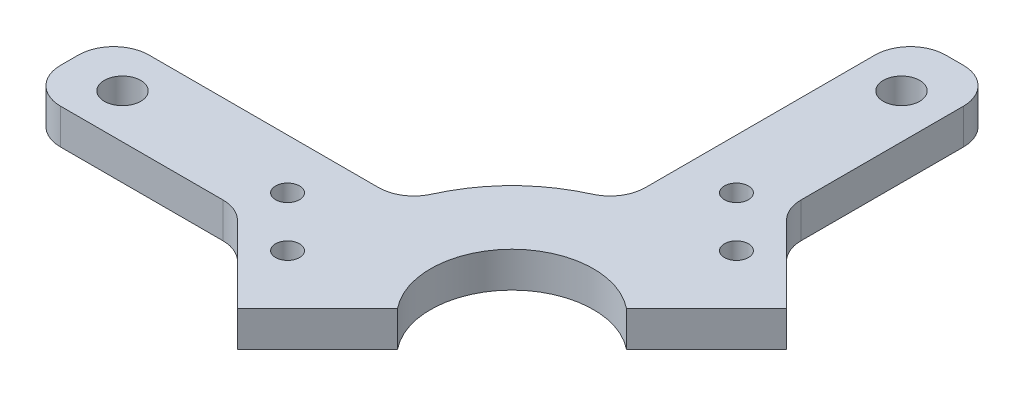
ISO-10303-21;
HEADER;
FILE_DESCRIPTION(('STEP AP214'),'2;1');
FILE_NAME('part.step','',(''),(''),'','','');
FILE_SCHEMA(('AUTOMOTIVE_DESIGN { 1 0 10303 214 1 1 1 1 }'));
ENDSEC;
DATA;
#1=APPLICATION_CONTEXT('core data for automotive mechanical design processes');
#2=APPLICATION_PROTOCOL_DEFINITION('international standard','automotive_design',2000,#1);
#3=PRODUCT_CONTEXT('',#1,'mechanical');
#4=PRODUCT('Part','Part','',(#3));
#5=PRODUCT_RELATED_PRODUCT_CATEGORY('part','',(#4));
#6=PRODUCT_DEFINITION_FORMATION('','',#4);
#7=PRODUCT_DEFINITION_CONTEXT('part definition',#1,'design');
#8=PRODUCT_DEFINITION('design','',#6,#7);
#9=PRODUCT_DEFINITION_SHAPE('','',#8);
#10=(LENGTH_UNIT() NAMED_UNIT(*) SI_UNIT(.MILLI.,.METRE.));
#11=(NAMED_UNIT(*) PLANE_ANGLE_UNIT() SI_UNIT($,.RADIAN.));
#12=(NAMED_UNIT(*) SI_UNIT($,.STERADIAN.) SOLID_ANGLE_UNIT());
#13=UNCERTAINTY_MEASURE_WITH_UNIT(LENGTH_MEASURE(1.E-05),#10,'distance_accuracy_value','');
#14=(GEOMETRIC_REPRESENTATION_CONTEXT(3) GLOBAL_UNCERTAINTY_ASSIGNED_CONTEXT((#13)) GLOBAL_UNIT_ASSIGNED_CONTEXT((#10,
#11,#12)) REPRESENTATION_CONTEXT('',''));
#15=CARTESIAN_POINT('',(0.,0.,0.));
#16=DIRECTION('',(0.,0.,1.));
#17=DIRECTION('',(1.,0.,0.));
#18=AXIS2_PLACEMENT_3D('',#15,#16,#17);
#19=CARTESIAN_POINT('',(7.93750000000073,0.,-73.0249999999999));
#20=DIRECTION('',(1.,0.,0.));
#21=DIRECTION('',(0.,0.,-1.));
#22=AXIS2_PLACEMENT_3D('',#19,#20,#21);
#23=PLANE('',#22);
#24=DIRECTION('',(0.,0.,-1.));
#25=VECTOR('',#24,1.);
#26=CARTESIAN_POINT('',(7.93750000000073,6.35,-73.0249999999999));
#27=LINE('',#26,#25);
#28=CARTESIAN_POINT('',(7.93750000000044,6.35,-43.9246129988201));
#29=VERTEX_POINT('',#28);
#30=CARTESIAN_POINT('',(7.93750000000073,6.35,-73.0249999999999));
#31=VERTEX_POINT('',#30);
#32=EDGE_CURVE('E234',#29,#31,#27,.T.);
#33=ORIENTED_EDGE('',*,*,#32,.F.);
#34=DIRECTION('',(0.,-1.,0.));
#35=VECTOR('',#34,1.);
#36=CARTESIAN_POINT('',(7.93750000000044,0.,-43.9246129988201));
#37=LINE('',#36,#35);
#38=CARTESIAN_POINT('',(7.93750000000044,0.,-43.9246129988201));
#39=VERTEX_POINT('',#38);
#40=EDGE_CURVE('E401',#29,#39,#37,.T.);
#41=ORIENTED_EDGE('',*,*,#40,.T.);
#42=DIRECTION('',(0.,0.,-1.));
#43=VECTOR('',#42,1.);
#44=CARTESIAN_POINT('',(7.93750000000073,0.,-73.0249999999999));
#45=LINE('',#44,#43);
#46=CARTESIAN_POINT('',(7.93750000000073,0.,-73.0249999999999));
#47=VERTEX_POINT('',#46);
#48=EDGE_CURVE('E302',#39,#47,#45,.T.);
#49=ORIENTED_EDGE('',*,*,#48,.T.);
#50=DIRECTION('',(0.,1.,0.));
#51=VECTOR('',#50,1.);
#52=CARTESIAN_POINT('',(7.93750000000073,0.,-73.0249999999999));
#53=LINE('',#52,#51);
#54=EDGE_CURVE('E297',#47,#31,#53,.T.);
#55=ORIENTED_EDGE('',*,*,#54,.T.);
#56=EDGE_LOOP('',(#33,#41,#49,#55));
#57=FACE_BOUND('',#56,.T.);
#58=ADVANCED_FACE('F38',(#57),#23,.T.);
#59=CARTESIAN_POINT('',(0.,6.35,0.));
#60=DIRECTION('',(0.,1.,0.));
#61=DIRECTION('',(0.,0.,1.));
#62=AXIS2_PLACEMENT_3D('',#59,#60,#61);
#63=PLANE('',#62);
#64=CARTESIAN_POINT('',(10.0230122421383,6.35,-30.2285885145439));
#65=DIRECTION('',(0.,1.,0.));
#66=DIRECTION('',(0.,0.,1.));
#67=AXIS2_PLACEMENT_3D('',#64,#65,#66);
#68=CIRCLE('',#67,2.15265);
#69=CARTESIAN_POINT('',(10.0230122421383,6.35,-28.0759385145439));
#70=VERTEX_POINT('',#69);
#71=EDGE_CURVE('E507',#70,#70,#68,.T.);
#72=ORIENTED_EDGE('',*,*,#71,.F.);
#73=EDGE_LOOP('',(#72));
#74=FACE_BOUND('',#73,.T.);
#75=CARTESIAN_POINT('',(1.04275612106917,6.35,-39.208844635613));
#76=DIRECTION('',(0.,1.,0.));
#77=DIRECTION('',(0.,0.,1.));
#78=AXIS2_PLACEMENT_3D('',#75,#76,#77);
#79=CIRCLE('',#78,2.15265);
#80=CARTESIAN_POINT('',(1.04275612106917,6.35,-37.056194635613));
#81=VERTEX_POINT('',#80);
#82=EDGE_CURVE('E495',#81,#81,#79,.T.);
#83=ORIENTED_EDGE('',*,*,#82,.F.);
#84=EDGE_LOOP('',(#83));
#85=FACE_BOUND('',#84,.T.);
#86=DIRECTION('',(0.,0.,1.));
#87=VECTOR('',#86,1.);
#88=CARTESIAN_POINT('',(-7.93749999999926,6.35,-73.0250000000001));
#89=LINE('',#88,#87);
#90=CARTESIAN_POINT('',(-7.93749999999926,6.35,-73.0250000000001));
#91=VERTEX_POINT('',#90);
#92=CARTESIAN_POINT('',(-7.93749999999969,6.35,-31.8688400910671));
#93=VERTEX_POINT('',#92);
#94=EDGE_CURVE('E315',#91,#93,#89,.T.);
#95=ORIENTED_EDGE('',*,*,#94,.T.);
#96=CARTESIAN_POINT('',(-14.2874999999997,6.35,-31.8688400910672));
#97=DIRECTION('',(0.,1.,0.));
#98=DIRECTION('',(0.,0.,1.));
#99=AXIS2_PLACEMENT_3D('',#96,#97,#98);
#100=CIRCLE('',#99,6.35);
#101=CARTESIAN_POINT('',(-11.6897727272725,6.35,-26.0745055290549));
#102=VERTEX_POINT('',#101);
#103=EDGE_CURVE('E392',#93,#102,#100,.F.);
#104=ORIENTED_EDGE('',*,*,#103,.T.);
#105=CARTESIAN_POINT('',(0.,6.35,0.));
#106=DIRECTION('',(0.,1.,0.));
#107=DIRECTION('',(0.,0.,1.));
#108=AXIS2_PLACEMENT_3D('',#105,#106,#107);
#109=CIRCLE('',#108,28.575);
#110=CARTESIAN_POINT('',(-26.0745055290548,6.35,-11.6897727272727));
#111=VERTEX_POINT('',#110);
#112=EDGE_CURVE('E281',#102,#111,#109,.T.);
#113=ORIENTED_EDGE('',*,*,#112,.T.);
#114=CARTESIAN_POINT('',(-31.868840091067,6.35,-14.2875));
#115=DIRECTION('',(0.,1.,0.));
#116=DIRECTION('',(0.,0.,1.));
#117=AXIS2_PLACEMENT_3D('',#114,#115,#116);
#118=CIRCLE('',#117,6.35);
#119=CARTESIAN_POINT('',(-31.868840091067,6.35,-7.93749999999998));
#120=VERTEX_POINT('',#119);
#121=EDGE_CURVE('E395',#111,#120,#118,.F.);
#122=ORIENTED_EDGE('',*,*,#121,.T.);
#123=DIRECTION('',(-1.,0.,0.));
#124=VECTOR('',#123,1.);
#125=CARTESIAN_POINT('',(-73.025,6.35,-7.93749999999997));
#126=LINE('',#125,#124);
#127=CARTESIAN_POINT('',(-73.025,6.35,-7.93749999999997));
#128=VERTEX_POINT('',#127);
#129=EDGE_CURVE('E278',#120,#128,#126,.T.);
#130=ORIENTED_EDGE('',*,*,#129,.T.);
#131=CARTESIAN_POINT('',(-73.025,6.35,-1.58749999999997));
#132=DIRECTION('',(0.,1.,0.));
#133=DIRECTION('',(0.,0.,1.));
#134=AXIS2_PLACEMENT_3D('',#131,#132,#133);
#135=CIRCLE('',#134,6.35);
#136=CARTESIAN_POINT('',(-79.375,6.35,-1.58749999999997));
#137=VERTEX_POINT('',#136);
#138=EDGE_CURVE('E274',#128,#137,#135,.T.);
#139=ORIENTED_EDGE('',*,*,#138,.T.);
#140=DIRECTION('',(0.,0.,1.));
#141=VECTOR('',#140,1.);
#142=CARTESIAN_POINT('',(-79.375,6.35,-1.58749999999997));
#143=LINE('',#142,#141);
#144=CARTESIAN_POINT('',(-79.375,6.35,1.58750000000003));
#145=VERTEX_POINT('',#144);
#146=EDGE_CURVE('E270',#137,#145,#143,.T.);
#147=ORIENTED_EDGE('',*,*,#146,.T.);
#148=CARTESIAN_POINT('',(-73.025,6.35,1.58750000000003));
#149=DIRECTION('',(0.,1.,0.));
#150=DIRECTION('',(0.,0.,-1.));
#151=AXIS2_PLACEMENT_3D('',#148,#149,#150);
#152=CIRCLE('',#151,6.35);
#153=CARTESIAN_POINT('',(-73.025,6.35,7.93750000000003));
#154=VERTEX_POINT('',#153);
#155=EDGE_CURVE('E266',#145,#154,#152,.T.);
#156=ORIENTED_EDGE('',*,*,#155,.T.);
#157=DIRECTION('',(1.,0.,0.));
#158=VECTOR('',#157,1.);
#159=CARTESIAN_POINT('',(-73.025,6.35,7.93750000000003));
#160=LINE('',#159,#158);
#161=CARTESIAN_POINT('',(-43.9246129988205,6.35,7.93750000000003));
#162=VERTEX_POINT('',#161);
#163=EDGE_CURVE('E262',#154,#162,#160,.T.);
#164=ORIENTED_EDGE('',*,*,#163,.T.);
#165=CARTESIAN_POINT('',(-43.9246129988205,6.35,14.2875));
#166=DIRECTION('',(0.,1.,0.));
#167=DIRECTION('',(0.,0.,1.));
#168=AXIS2_PLACEMENT_3D('',#165,#166,#167);
#169=CIRCLE('',#168,6.35);
#170=CARTESIAN_POINT('',(-39.4344849382859,6.35,9.79737193946545));
#171=VERTEX_POINT('',#170);
#172=EDGE_CURVE('E11',#162,#171,#169,.F.);
#173=ORIENTED_EDGE('',*,*,#172,.T.);
#174=DIRECTION('',(0.707106781186548,0.,0.707106781186547));
#175=VECTOR('',#174,1.);
#176=CARTESIAN_POINT('',(-25.7384604540093,6.35,23.4933964237421));
#177=LINE('',#176,#175);
#178=CARTESIAN_POINT('',(-25.7384604540093,6.35,23.4933964237421));
#179=VERTEX_POINT('',#178);
#180=EDGE_CURVE('E224',#171,#179,#177,.T.);
#181=ORIENTED_EDGE('',*,*,#180,.T.);
#182=DIRECTION('',(-0.707106781186546,0.,0.707106781186549));
#183=VECTOR('',#182,1.);
#184=CARTESIAN_POINT('',(-38.2941829917116,6.35,36.0491189614445));
#185=LINE('',#184,#183);
#186=CARTESIAN_POINT('',(-11.3886381111663,6.35,9.14357408089908));
#187=VERTEX_POINT('',#186);
#188=EDGE_CURVE('E242',#187,#179,#185,.T.);
#189=ORIENTED_EDGE('',*,*,#188,.F.);
#190=CARTESIAN_POINT('',(0.,6.35,0.));
#191=DIRECTION('',(0.,1.,0.));
#192=DIRECTION('',(0.,0.,1.));
#193=AXIS2_PLACEMENT_3D('',#190,#191,#192);
#194=CIRCLE('',#193,14.605);
#195=CARTESIAN_POINT('',(9.14357408089904,6.35,-11.3886381111664));
#196=VERTEX_POINT('',#195);
#197=EDGE_CURVE('E362',#196,#187,#194,.T.);
#198=ORIENTED_EDGE('',*,*,#197,.F.);
#199=CARTESIAN_POINT('',(23.4933964237421,6.35,-25.7384604540093));
#200=VERTEX_POINT('',#199);
#201=EDGE_CURVE('E238',#200,#196,#185,.T.);
#202=ORIENTED_EDGE('',*,*,#201,.F.);
#203=DIRECTION('',(0.707106781186547,0.,0.707106781186547));
#204=VECTOR('',#203,1.);
#205=CARTESIAN_POINT('',(23.4933964237421,6.35,-25.7384604540093));
#206=LINE('',#205,#204);
#207=CARTESIAN_POINT('',(9.79737193946587,6.35,-39.4344849382855));
#208=VERTEX_POINT('',#207);
#209=EDGE_CURVE('E188',#208,#200,#206,.T.);
#210=ORIENTED_EDGE('',*,*,#209,.F.);
#211=CARTESIAN_POINT('',(14.2875000000004,6.35,-43.9246129988201));
#212=DIRECTION('',(0.,1.,0.));
#213=DIRECTION('',(0.,0.,1.));
#214=AXIS2_PLACEMENT_3D('',#211,#212,#213);
#215=CIRCLE('',#214,6.35);
#216=EDGE_CURVE('E416',#208,#29,#215,.F.);
#217=ORIENTED_EDGE('',*,*,#216,.T.);
#218=ORIENTED_EDGE('',*,*,#32,.T.);
#219=CARTESIAN_POINT('',(1.58750000000073,6.35,-73.025));
#220=DIRECTION('',(0.,1.,0.));
#221=DIRECTION('',(-1.,0.,0.));
#222=AXIS2_PLACEMENT_3D('',#219,#220,#221);
#223=CIRCLE('',#222,6.35);
#224=CARTESIAN_POINT('',(1.5875000000008,6.35,-79.375));
#225=VERTEX_POINT('',#224);
#226=EDGE_CURVE('E326',#31,#225,#223,.T.);
#227=ORIENTED_EDGE('',*,*,#226,.T.);
#228=DIRECTION('',(-1.,0.,0.));
#229=VECTOR('',#228,1.);
#230=CARTESIAN_POINT('',(1.5875000000008,6.35,-79.375));
#231=LINE('',#230,#229);
#232=CARTESIAN_POINT('',(-1.5874999999992,6.35,-79.375));
#233=VERTEX_POINT('',#232);
#234=EDGE_CURVE('E322',#225,#233,#231,.T.);
#235=ORIENTED_EDGE('',*,*,#234,.T.);
#236=CARTESIAN_POINT('',(-1.58749999999927,6.35,-73.025));
#237=DIRECTION('',(0.,1.,0.));
#238=DIRECTION('',(1.,0.,0.));
#239=AXIS2_PLACEMENT_3D('',#236,#237,#238);
#240=CIRCLE('',#239,6.35);
#241=EDGE_CURVE('E318',#233,#91,#240,.T.);
#242=ORIENTED_EDGE('',*,*,#241,.T.);
#243=EDGE_LOOP('',(#95,#104,#113,#122,#130,#139,#147,#156,#164,#173,#181,#189,#198,#202,#210,
#217,#218,#227,#235,#242));
#244=FACE_BOUND('',#243,.T.);
#245=CARTESIAN_POINT('',(7.31639914554578E-13,6.35,-69.85));
#246=DIRECTION('',(0.,1.,0.));
#247=DIRECTION('',(0.,0.,1.));
#248=AXIS2_PLACEMENT_3D('',#245,#246,#247);
#249=CIRCLE('',#248,3.2639);
#250=CARTESIAN_POINT('',(7.31639914554578E-13,6.35,-66.5861));
#251=VERTEX_POINT('',#250);
#252=EDGE_CURVE('E243',#251,#251,#249,.T.);
#253=ORIENTED_EDGE('',*,*,#252,.F.);
#254=EDGE_LOOP('',(#253));
#255=FACE_BOUND('',#254,.T.);
#256=CARTESIAN_POINT('',(-30.2285885145439,6.35,10.0230122421383));
#257=DIRECTION('',(0.,1.,0.));
#258=DIRECTION('',(0.,0.,1.));
#259=AXIS2_PLACEMENT_3D('',#256,#257,#258);
#260=CIRCLE('',#259,2.15265);
#261=CARTESIAN_POINT('',(-30.2285885145439,6.35,12.1756622421383));
#262=VERTEX_POINT('',#261);
#263=EDGE_CURVE('E205',#262,#262,#260,.T.);
#264=ORIENTED_EDGE('',*,*,#263,.F.);
#265=EDGE_LOOP('',(#264));
#266=FACE_BOUND('',#265,.T.);
#267=CARTESIAN_POINT('',(-39.208844635613,6.35,1.04275612106918));
#268=DIRECTION('',(0.,1.,0.));
#269=DIRECTION('',(0.,0.,1.));
#270=AXIS2_PLACEMENT_3D('',#267,#268,#269);
#271=CIRCLE('',#270,2.15265);
#272=CARTESIAN_POINT('',(-39.208844635613,6.35,3.19540612106918));
#273=VERTEX_POINT('',#272);
#274=EDGE_CURVE('E216',#273,#273,#271,.T.);
#275=ORIENTED_EDGE('',*,*,#274,.F.);
#276=EDGE_LOOP('',(#275));
#277=FACE_BOUND('',#276,.T.);
#278=CARTESIAN_POINT('',(-69.85,6.35,0.));
#279=DIRECTION('',(0.,1.,0.));
#280=DIRECTION('',(0.,0.,1.));
#281=AXIS2_PLACEMENT_3D('',#278,#279,#280);
#282=CIRCLE('',#281,3.2639);
#283=CARTESIAN_POINT('',(-69.85,6.35,3.2639));
#284=VERTEX_POINT('',#283);
#285=EDGE_CURVE('E306',#284,#284,#282,.T.);
#286=ORIENTED_EDGE('',*,*,#285,.F.);
#287=EDGE_LOOP('',(#286));
#288=FACE_BOUND('',#287,.T.);
#289=ADVANCED_FACE('F426',(#74,#85,#244,#255,#266,#277,#288),#63,.T.);
#290=CARTESIAN_POINT('',(0.,0.,0.));
#291=DIRECTION('',(0.,1.,0.));
#292=DIRECTION('',(0.,0.,1.));
#293=AXIS2_PLACEMENT_3D('',#290,#291,#292);
#294=PLANE('',#293);
#295=CARTESIAN_POINT('',(10.0230122421383,0.,-30.2285885145439));
#296=DIRECTION('',(0.,1.,0.));
#297=DIRECTION('',(0.,0.,1.));
#298=AXIS2_PLACEMENT_3D('',#295,#296,#297);
#299=CIRCLE('',#298,2.15265);
#300=CARTESIAN_POINT('',(10.0230122421383,0.,-28.0759385145439));
#301=VERTEX_POINT('',#300);
#302=EDGE_CURVE('E501',#301,#301,#299,.T.);
#303=ORIENTED_EDGE('',*,*,#302,.T.);
#304=EDGE_LOOP('',(#303));
#305=FACE_BOUND('',#304,.T.);
#306=CARTESIAN_POINT('',(1.04275612106917,0.,-39.208844635613));
#307=DIRECTION('',(0.,1.,0.));
#308=DIRECTION('',(0.,0.,1.));
#309=AXIS2_PLACEMENT_3D('',#306,#307,#308);
#310=CIRCLE('',#309,2.15265);
#311=CARTESIAN_POINT('',(1.04275612106917,0.,-37.056194635613));
#312=VERTEX_POINT('',#311);
#313=EDGE_CURVE('E492',#312,#312,#310,.T.);
#314=ORIENTED_EDGE('',*,*,#313,.T.);
#315=EDGE_LOOP('',(#314));
#316=FACE_BOUND('',#315,.T.);
#317=DIRECTION('',(-0.707106781186546,0.,0.707106781186549));
#318=VECTOR('',#317,1.);
#319=CARTESIAN_POINT('',(-38.2941829917116,0.,36.0491189614445));
#320=LINE('',#319,#318);
#321=CARTESIAN_POINT('',(23.4933964237421,0.,-25.7384604540093));
#322=VERTEX_POINT('',#321);
#323=CARTESIAN_POINT('',(9.14357408089904,0.,-11.3886381111664));
#324=VERTEX_POINT('',#323);
#325=EDGE_CURVE('E179',#322,#324,#320,.T.);
#326=ORIENTED_EDGE('',*,*,#325,.T.);
#327=CARTESIAN_POINT('',(0.,0.,0.));
#328=DIRECTION('',(0.,1.,0.));
#329=DIRECTION('',(0.,0.,1.));
#330=AXIS2_PLACEMENT_3D('',#327,#328,#329);
#331=CIRCLE('',#330,14.605);
#332=CARTESIAN_POINT('',(-11.3886381111663,0.,9.14357408089908));
#333=VERTEX_POINT('',#332);
#334=EDGE_CURVE('E197',#324,#333,#331,.T.);
#335=ORIENTED_EDGE('',*,*,#334,.T.);
#336=CARTESIAN_POINT('',(-25.7384604540093,0.,23.4933964237421));
#337=VERTEX_POINT('',#336);
#338=EDGE_CURVE('E200',#333,#337,#320,.T.);
#339=ORIENTED_EDGE('',*,*,#338,.T.);
#340=DIRECTION('',(0.707106781186548,0.,0.707106781186547));
#341=VECTOR('',#340,1.);
#342=CARTESIAN_POINT('',(-25.7384604540093,0.,23.4933964237421));
#343=LINE('',#342,#341);
#344=CARTESIAN_POINT('',(-39.4344849382859,0.,9.79737193946545));
#345=VERTEX_POINT('',#344);
#346=EDGE_CURVE('E225',#345,#337,#343,.T.);
#347=ORIENTED_EDGE('',*,*,#346,.F.);
#348=CARTESIAN_POINT('',(-43.9246129988205,0.,14.2875));
#349=DIRECTION('',(0.,1.,0.));
#350=DIRECTION('',(0.,0.,1.));
#351=AXIS2_PLACEMENT_3D('',#348,#349,#350);
#352=CIRCLE('',#351,6.35);
#353=CARTESIAN_POINT('',(-43.9246129988205,0.,7.93750000000003));
#354=VERTEX_POINT('',#353);
#355=EDGE_CURVE('E47',#345,#354,#352,.T.);
#356=ORIENTED_EDGE('',*,*,#355,.T.);
#357=DIRECTION('',(1.,0.,0.));
#358=VECTOR('',#357,1.);
#359=CARTESIAN_POINT('',(-73.025,0.,7.93750000000003));
#360=LINE('',#359,#358);
#361=CARTESIAN_POINT('',(-73.025,0.,7.93750000000003));
#362=VERTEX_POINT('',#361);
#363=EDGE_CURVE('E282',#362,#354,#360,.T.);
#364=ORIENTED_EDGE('',*,*,#363,.F.);
#365=CARTESIAN_POINT('',(-73.025,0.,1.58750000000003));
#366=DIRECTION('',(0.,1.,0.));
#367=DIRECTION('',(0.,0.,-1.));
#368=AXIS2_PLACEMENT_3D('',#365,#366,#367);
#369=CIRCLE('',#368,6.35);
#370=CARTESIAN_POINT('',(-79.375,0.,1.58750000000003));
#371=VERTEX_POINT('',#370);
#372=EDGE_CURVE('E248',#371,#362,#369,.T.);
#373=ORIENTED_EDGE('',*,*,#372,.F.);
#374=DIRECTION('',(0.,0.,1.));
#375=VECTOR('',#374,1.);
#376=CARTESIAN_POINT('',(-79.375,0.,-1.58749999999997));
#377=LINE('',#376,#375);
#378=CARTESIAN_POINT('',(-79.375,0.,-1.58749999999997));
#379=VERTEX_POINT('',#378);
#380=EDGE_CURVE('E258',#379,#371,#377,.T.);
#381=ORIENTED_EDGE('',*,*,#380,.F.);
#382=CARTESIAN_POINT('',(-73.025,0.,-1.58749999999997));
#383=DIRECTION('',(0.,1.,0.));
#384=DIRECTION('',(0.,0.,1.));
#385=AXIS2_PLACEMENT_3D('',#382,#383,#384);
#386=CIRCLE('',#385,6.35);
#387=CARTESIAN_POINT('',(-73.025,0.,-7.93749999999997));
#388=VERTEX_POINT('',#387);
#389=EDGE_CURVE('E254',#388,#379,#386,.T.);
#390=ORIENTED_EDGE('',*,*,#389,.F.);
#391=DIRECTION('',(-1.,0.,0.));
#392=VECTOR('',#391,1.);
#393=CARTESIAN_POINT('',(-73.025,0.,-7.93749999999997));
#394=LINE('',#393,#392);
#395=CARTESIAN_POINT('',(-31.868840091067,0.,-7.93749999999998));
#396=VERTEX_POINT('',#395);
#397=EDGE_CURVE('E249',#396,#388,#394,.T.);
#398=ORIENTED_EDGE('',*,*,#397,.F.);
#399=CARTESIAN_POINT('',(-31.868840091067,0.,-14.2875));
#400=DIRECTION('',(0.,1.,0.));
#401=DIRECTION('',(0.,0.,1.));
#402=AXIS2_PLACEMENT_3D('',#399,#400,#401);
#403=CIRCLE('',#402,6.35);
#404=CARTESIAN_POINT('',(-26.0745055290548,0.,-11.6897727272727));
#405=VERTEX_POINT('',#404);
#406=EDGE_CURVE('E398',#396,#405,#403,.T.);
#407=ORIENTED_EDGE('',*,*,#406,.T.);
#408=CARTESIAN_POINT('',(0.,0.,0.));
#409=DIRECTION('',(0.,1.,0.));
#410=DIRECTION('',(0.,0.,1.));
#411=AXIS2_PLACEMENT_3D('',#408,#409,#410);
#412=CIRCLE('',#411,28.575);
#413=CARTESIAN_POINT('',(-11.6897727272725,0.,-26.0745055290549));
#414=VERTEX_POINT('',#413);
#415=EDGE_CURVE('E285',#414,#405,#412,.T.);
#416=ORIENTED_EDGE('',*,*,#415,.F.);
#417=CARTESIAN_POINT('',(-14.2874999999997,0.,-31.8688400910672));
#418=DIRECTION('',(0.,1.,0.));
#419=DIRECTION('',(0.,0.,1.));
#420=AXIS2_PLACEMENT_3D('',#417,#418,#419);
#421=CIRCLE('',#420,6.35);
#422=CARTESIAN_POINT('',(-7.93749999999969,0.,-31.8688400910671));
#423=VERTEX_POINT('',#422);
#424=EDGE_CURVE('E388',#414,#423,#421,.T.);
#425=ORIENTED_EDGE('',*,*,#424,.T.);
#426=DIRECTION('',(0.,0.,1.));
#427=VECTOR('',#426,1.);
#428=CARTESIAN_POINT('',(-7.93749999999926,0.,-73.0250000000001));
#429=LINE('',#428,#427);
#430=CARTESIAN_POINT('',(-7.93749999999926,0.,-73.0250000000001));
#431=VERTEX_POINT('',#430);
#432=EDGE_CURVE('E253',#431,#423,#429,.T.);
#433=ORIENTED_EDGE('',*,*,#432,.F.);
#434=CARTESIAN_POINT('',(-1.58749999999927,0.,-73.025));
#435=DIRECTION('',(0.,1.,0.));
#436=DIRECTION('',(1.,0.,0.));
#437=AXIS2_PLACEMENT_3D('',#434,#435,#436);
#438=CIRCLE('',#437,6.35);
#439=CARTESIAN_POINT('',(-1.5874999999992,0.,-79.375));
#440=VERTEX_POINT('',#439);
#441=EDGE_CURVE('E301',#440,#431,#438,.T.);
#442=ORIENTED_EDGE('',*,*,#441,.F.);
#443=DIRECTION('',(-1.,0.,0.));
#444=VECTOR('',#443,1.);
#445=CARTESIAN_POINT('',(1.5875000000008,0.,-79.375));
#446=LINE('',#445,#444);
#447=CARTESIAN_POINT('',(1.5875000000008,0.,-79.375));
#448=VERTEX_POINT('',#447);
#449=EDGE_CURVE('E311',#448,#440,#446,.T.);
#450=ORIENTED_EDGE('',*,*,#449,.F.);
#451=CARTESIAN_POINT('',(1.58750000000073,0.,-73.025));
#452=DIRECTION('',(0.,1.,0.));
#453=DIRECTION('',(-1.,0.,0.));
#454=AXIS2_PLACEMENT_3D('',#451,#452,#453);
#455=CIRCLE('',#454,6.35);
#456=EDGE_CURVE('E307',#47,#448,#455,.T.);
#457=ORIENTED_EDGE('',*,*,#456,.F.);
#458=ORIENTED_EDGE('',*,*,#48,.F.);
#459=CARTESIAN_POINT('',(14.2875000000004,0.,-43.9246129988201));
#460=DIRECTION('',(0.,1.,0.));
#461=DIRECTION('',(0.,0.,1.));
#462=AXIS2_PLACEMENT_3D('',#459,#460,#461);
#463=CIRCLE('',#462,6.35);
#464=CARTESIAN_POINT('',(9.79737193946587,0.,-39.4344849382855));
#465=VERTEX_POINT('',#464);
#466=EDGE_CURVE('E182',#39,#465,#463,.T.);
#467=ORIENTED_EDGE('',*,*,#466,.T.);
#468=DIRECTION('',(0.707106781186547,0.,0.707106781186547));
#469=VECTOR('',#468,1.);
#470=CARTESIAN_POINT('',(23.4933964237421,0.,-25.7384604540093));
#471=LINE('',#470,#469);
#472=EDGE_CURVE('E174',#465,#322,#471,.T.);
#473=ORIENTED_EDGE('',*,*,#472,.T.);
#474=EDGE_LOOP('',(#326,#335,#339,#347,#356,#364,#373,#381,#390,#398,#407,#416,#425,#433,#442,
#450,#457,#458,#467,#473));
#475=FACE_BOUND('',#474,.T.);
#476=CARTESIAN_POINT('',(7.31639914554578E-13,0.,-69.85));
#477=DIRECTION('',(0.,1.,0.));
#478=DIRECTION('',(0.,0.,1.));
#479=AXIS2_PLACEMENT_3D('',#476,#477,#478);
#480=CIRCLE('',#479,3.2639);
#481=CARTESIAN_POINT('',(7.31639914554578E-13,0.,-66.5861));
#482=VERTEX_POINT('',#481);
#483=EDGE_CURVE('E198',#482,#482,#480,.T.);
#484=ORIENTED_EDGE('',*,*,#483,.T.);
#485=EDGE_LOOP('',(#484));
#486=FACE_BOUND('',#485,.T.);
#487=CARTESIAN_POINT('',(-69.85,0.,0.));
#488=DIRECTION('',(0.,1.,0.));
#489=DIRECTION('',(0.,0.,1.));
#490=AXIS2_PLACEMENT_3D('',#487,#488,#489);
#491=CIRCLE('',#490,3.2639);
#492=CARTESIAN_POINT('',(-69.85,0.,3.2639));
#493=VERTEX_POINT('',#492);
#494=EDGE_CURVE('E265',#493,#493,#491,.T.);
#495=ORIENTED_EDGE('',*,*,#494,.T.);
#496=EDGE_LOOP('',(#495));
#497=FACE_BOUND('',#496,.T.);
#498=CARTESIAN_POINT('',(-39.208844635613,0.,1.04275612106918));
#499=DIRECTION('',(0.,1.,0.));
#500=DIRECTION('',(0.,0.,1.));
#501=AXIS2_PLACEMENT_3D('',#498,#499,#500);
#502=CIRCLE('',#501,2.15265);
#503=CARTESIAN_POINT('',(-39.208844635613,0.,3.19540612106918));
#504=VERTEX_POINT('',#503);
#505=EDGE_CURVE('E220',#504,#504,#502,.T.);
#506=ORIENTED_EDGE('',*,*,#505,.T.);
#507=EDGE_LOOP('',(#506));
#508=FACE_BOUND('',#507,.T.);
#509=CARTESIAN_POINT('',(-30.2285885145439,0.,10.0230122421383));
#510=DIRECTION('',(0.,1.,0.));
#511=DIRECTION('',(0.,0.,1.));
#512=AXIS2_PLACEMENT_3D('',#509,#510,#511);
#513=CIRCLE('',#512,2.15265);
#514=CARTESIAN_POINT('',(-30.2285885145439,0.,12.1756622421383));
#515=VERTEX_POINT('',#514);
#516=EDGE_CURVE('E209',#515,#515,#513,.T.);
#517=ORIENTED_EDGE('',*,*,#516,.T.);
#518=EDGE_LOOP('',(#517));
#519=FACE_BOUND('',#518,.T.);
#520=ADVANCED_FACE('F176',(#305,#316,#475,#486,#497,#508,#519),#294,.F.);
#521=CARTESIAN_POINT('',(0.,6.35,0.));
#522=DIRECTION('',(0.,-1.,0.));
#523=DIRECTION('',(0.,0.,-1.));
#524=AXIS2_PLACEMENT_3D('',#521,#522,#523);
#525=CYLINDRICAL_SURFACE('',#524,14.605);
#526=DIRECTION('',(0.,-1.,0.));
#527=VECTOR('',#526,1.);
#528=CARTESIAN_POINT('',(9.14357408089904,6.35,-11.3886381111664));
#529=LINE('',#528,#527);
#530=EDGE_CURVE('E194',#196,#324,#529,.T.);
#531=ORIENTED_EDGE('',*,*,#530,.F.);
#532=ORIENTED_EDGE('',*,*,#197,.T.);
#533=DIRECTION('',(0.,-1.,0.));
#534=VECTOR('',#533,1.);
#535=CARTESIAN_POINT('',(-11.3886381111663,6.35,9.14357408089908));
#536=LINE('',#535,#534);
#537=EDGE_CURVE('E239',#333,#187,#536,.F.);
#538=ORIENTED_EDGE('',*,*,#537,.F.);
#539=ORIENTED_EDGE('',*,*,#334,.F.);
#540=EDGE_LOOP('',(#531,#532,#538,#539));
#541=FACE_BOUND('',#540,.T.);
#542=ADVANCED_FACE('F423',(#541),#525,.F.);
#543=CARTESIAN_POINT('',(0.,6.35,0.));
#544=DIRECTION('',(0.,-1.,0.));
#545=DIRECTION('',(0.,0.,-1.));
#546=AXIS2_PLACEMENT_3D('',#543,#544,#545);
#547=CYLINDRICAL_SURFACE('',#546,28.575);
#548=ORIENTED_EDGE('',*,*,#112,.F.);
#549=DIRECTION('',(0.,-1.,0.));
#550=VECTOR('',#549,1.);
#551=CARTESIAN_POINT('',(-11.6897727272725,6.35,-26.0745055290549));
#552=LINE('',#551,#550);
#553=EDGE_CURVE('E377',#102,#414,#552,.T.);
#554=ORIENTED_EDGE('',*,*,#553,.T.);
#555=ORIENTED_EDGE('',*,*,#415,.T.);
#556=DIRECTION('',(0.,-1.,0.));
#557=VECTOR('',#556,1.);
#558=CARTESIAN_POINT('',(-26.0745055290548,6.35,-11.6897727272727));
#559=LINE('',#558,#557);
#560=EDGE_CURVE('E237',#405,#111,#559,.F.);
#561=ORIENTED_EDGE('',*,*,#560,.T.);
#562=EDGE_LOOP('',(#548,#554,#555,#561));
#563=FACE_BOUND('',#562,.T.);
#564=ADVANCED_FACE('F461',(#563),#547,.T.);
#565=CARTESIAN_POINT('',(-73.025,0.,7.93750000000003));
#566=DIRECTION('',(0.,0.,1.));
#567=DIRECTION('',(1.,0.,0.));
#568=AXIS2_PLACEMENT_3D('',#565,#566,#567);
#569=PLANE('',#568);
#570=ORIENTED_EDGE('',*,*,#363,.T.);
#571=DIRECTION('',(0.,-1.,0.));
#572=VECTOR('',#571,1.);
#573=CARTESIAN_POINT('',(-43.9246129988205,6.35,7.93750000000002));
#574=LINE('',#573,#572);
#575=EDGE_CURVE('E60',#354,#162,#574,.F.);
#576=ORIENTED_EDGE('',*,*,#575,.T.);
#577=ORIENTED_EDGE('',*,*,#163,.F.);
#578=DIRECTION('',(0.,1.,0.));
#579=VECTOR('',#578,1.);
#580=CARTESIAN_POINT('',(-73.025,0.,7.93750000000003));
#581=LINE('',#580,#579);
#582=EDGE_CURVE('E259',#362,#154,#581,.T.);
#583=ORIENTED_EDGE('',*,*,#582,.F.);
#584=EDGE_LOOP('',(#570,#576,#577,#583));
#585=FACE_BOUND('',#584,.T.);
#586=ADVANCED_FACE('F438',(#585),#569,.T.);
#587=CARTESIAN_POINT('',(-73.025,0.,-7.93749999999997));
#588=DIRECTION('',(0.,0.,-1.));
#589=DIRECTION('',(-1.,0.,0.));
#590=AXIS2_PLACEMENT_3D('',#587,#588,#589);
#591=PLANE('',#590);
#592=DIRECTION('',(0.,1.,0.));
#593=VECTOR('',#592,1.);
#594=CARTESIAN_POINT('',(-73.025,0.,-7.93749999999997));
#595=LINE('',#594,#593);
#596=EDGE_CURVE('E244',#388,#128,#595,.T.);
#597=ORIENTED_EDGE('',*,*,#596,.T.);
#598=ORIENTED_EDGE('',*,*,#129,.F.);
#599=DIRECTION('',(0.,-1.,0.));
#600=VECTOR('',#599,1.);
#601=CARTESIAN_POINT('',(-31.868840091067,0.,-7.93749999999998));
#602=LINE('',#601,#600);
#603=EDGE_CURVE('E385',#120,#396,#602,.T.);
#604=ORIENTED_EDGE('',*,*,#603,.T.);
#605=ORIENTED_EDGE('',*,*,#397,.T.);
#606=EDGE_LOOP('',(#597,#598,#604,#605));
#607=FACE_BOUND('',#606,.T.);
#608=ADVANCED_FACE('F608',(#607),#591,.T.);
#609=CARTESIAN_POINT('',(-73.025,0.,1.58750000000003));
#610=DIRECTION('',(0.,1.,0.));
#611=DIRECTION('',(0.,0.,1.));
#612=AXIS2_PLACEMENT_3D('',#609,#610,#611);
#613=CYLINDRICAL_SURFACE('',#612,6.35);
#614=ORIENTED_EDGE('',*,*,#155,.F.);
#615=DIRECTION('',(0.,1.,0.));
#616=VECTOR('',#615,1.);
#617=CARTESIAN_POINT('',(-79.375,0.,1.58750000000003));
#618=LINE('',#617,#616);
#619=EDGE_CURVE('E255',#371,#145,#618,.T.);
#620=ORIENTED_EDGE('',*,*,#619,.F.);
#621=ORIENTED_EDGE('',*,*,#372,.T.);
#622=ORIENTED_EDGE('',*,*,#582,.T.);
#623=EDGE_LOOP('',(#614,#620,#621,#622));
#624=FACE_BOUND('',#623,.T.);
#625=ADVANCED_FACE('F441',(#624),#613,.T.);
#626=CARTESIAN_POINT('',(-79.375,0.,-1.58749999999997));
#627=DIRECTION('',(-1.,0.,0.));
#628=DIRECTION('',(0.,0.,1.));
#629=AXIS2_PLACEMENT_3D('',#626,#627,#628);
#630=PLANE('',#629);
#631=ORIENTED_EDGE('',*,*,#146,.F.);
#632=DIRECTION('',(0.,1.,0.));
#633=VECTOR('',#632,1.);
#634=CARTESIAN_POINT('',(-79.375,0.,-1.58749999999997));
#635=LINE('',#634,#633);
#636=EDGE_CURVE('E250',#379,#137,#635,.T.);
#637=ORIENTED_EDGE('',*,*,#636,.F.);
#638=ORIENTED_EDGE('',*,*,#380,.T.);
#639=ORIENTED_EDGE('',*,*,#619,.T.);
#640=EDGE_LOOP('',(#631,#637,#638,#639));
#641=FACE_BOUND('',#640,.T.);
#642=ADVANCED_FACE('F446',(#641),#630,.T.);
#643=CARTESIAN_POINT('',(-73.025,0.,-1.58749999999997));
#644=DIRECTION('',(0.,1.,0.));
#645=DIRECTION('',(0.,0.,1.));
#646=AXIS2_PLACEMENT_3D('',#643,#644,#645);
#647=CYLINDRICAL_SURFACE('',#646,6.35);
#648=ORIENTED_EDGE('',*,*,#138,.F.);
#649=ORIENTED_EDGE('',*,*,#596,.F.);
#650=ORIENTED_EDGE('',*,*,#389,.T.);
#651=ORIENTED_EDGE('',*,*,#636,.T.);
#652=EDGE_LOOP('',(#648,#649,#650,#651));
#653=FACE_BOUND('',#652,.T.);
#654=ADVANCED_FACE('F449',(#653),#647,.T.);
#655=CARTESIAN_POINT('',(-7.93749999999926,0.,-73.0250000000001));
#656=DIRECTION('',(-1.,0.,0.));
#657=DIRECTION('',(0.,0.,1.));
#658=AXIS2_PLACEMENT_3D('',#655,#656,#657);
#659=PLANE('',#658);
#660=DIRECTION('',(0.,-1.,0.));
#661=VECTOR('',#660,1.);
#662=CARTESIAN_POINT('',(-7.93749999999969,0.,-31.8688400910671));
#663=LINE('',#662,#661);
#664=EDGE_CURVE('E381',#423,#93,#663,.F.);
#665=ORIENTED_EDGE('',*,*,#664,.T.);
#666=ORIENTED_EDGE('',*,*,#94,.F.);
#667=DIRECTION('',(0.,1.,0.));
#668=VECTOR('',#667,1.);
#669=CARTESIAN_POINT('',(-7.93749999999926,0.,-73.0250000000001));
#670=LINE('',#669,#668);
#671=EDGE_CURVE('E312',#431,#91,#670,.T.);
#672=ORIENTED_EDGE('',*,*,#671,.F.);
#673=ORIENTED_EDGE('',*,*,#432,.T.);
#674=EDGE_LOOP('',(#665,#666,#672,#673));
#675=FACE_BOUND('',#674,.T.);
#676=ADVANCED_FACE('F473',(#675),#659,.T.);
#677=CARTESIAN_POINT('',(-1.58749999999927,0.,-73.025));
#678=DIRECTION('',(0.,1.,0.));
#679=DIRECTION('',(0.,0.,1.));
#680=AXIS2_PLACEMENT_3D('',#677,#678,#679);
#681=CYLINDRICAL_SURFACE('',#680,6.35);
#682=ORIENTED_EDGE('',*,*,#241,.F.);
#683=DIRECTION('',(0.,1.,0.));
#684=VECTOR('',#683,1.);
#685=CARTESIAN_POINT('',(-1.5874999999992,0.,-79.375));
#686=LINE('',#685,#684);
#687=EDGE_CURVE('E308',#440,#233,#686,.T.);
#688=ORIENTED_EDGE('',*,*,#687,.F.);
#689=ORIENTED_EDGE('',*,*,#441,.T.);
#690=ORIENTED_EDGE('',*,*,#671,.T.);
#691=EDGE_LOOP('',(#682,#688,#689,#690));
#692=FACE_BOUND('',#691,.T.);
#693=ADVANCED_FACE('F476',(#692),#681,.T.);
#694=CARTESIAN_POINT('',(1.5875000000008,0.,-79.375));
#695=DIRECTION('',(0.,0.,-1.));
#696=DIRECTION('',(-1.,0.,0.));
#697=AXIS2_PLACEMENT_3D('',#694,#695,#696);
#698=PLANE('',#697);
#699=ORIENTED_EDGE('',*,*,#234,.F.);
#700=DIRECTION('',(0.,1.,0.));
#701=VECTOR('',#700,1.);
#702=CARTESIAN_POINT('',(1.5875000000008,0.,-79.375));
#703=LINE('',#702,#701);
#704=EDGE_CURVE('E303',#448,#225,#703,.T.);
#705=ORIENTED_EDGE('',*,*,#704,.F.);
#706=ORIENTED_EDGE('',*,*,#449,.T.);
#707=ORIENTED_EDGE('',*,*,#687,.T.);
#708=EDGE_LOOP('',(#699,#705,#706,#707));
#709=FACE_BOUND('',#708,.T.);
#710=ADVANCED_FACE('F479',(#709),#698,.T.);
#711=CARTESIAN_POINT('',(1.58750000000073,0.,-73.025));
#712=DIRECTION('',(0.,1.,0.));
#713=DIRECTION('',(0.,0.,1.));
#714=AXIS2_PLACEMENT_3D('',#711,#712,#713);
#715=CYLINDRICAL_SURFACE('',#714,6.35);
#716=ORIENTED_EDGE('',*,*,#226,.F.);
#717=ORIENTED_EDGE('',*,*,#54,.F.);
#718=ORIENTED_EDGE('',*,*,#456,.T.);
#719=ORIENTED_EDGE('',*,*,#704,.T.);
#720=EDGE_LOOP('',(#716,#717,#718,#719));
#721=FACE_BOUND('',#720,.T.);
#722=ADVANCED_FACE('F484',(#721),#715,.T.);
#723=CARTESIAN_POINT('',(-69.85,6.35,0.));
#724=DIRECTION('',(0.,1.,0.));
#725=DIRECTION('',(0.,0.,1.));
#726=AXIS2_PLACEMENT_3D('',#723,#724,#725);
#727=CYLINDRICAL_SURFACE('',#726,3.2639);
#728=ORIENTED_EDGE('',*,*,#494,.F.);
#729=EDGE_LOOP('',(#728));
#730=FACE_BOUND('',#729,.T.);
#731=ORIENTED_EDGE('',*,*,#285,.T.);
#732=EDGE_LOOP('',(#731));
#733=FACE_BOUND('',#732,.T.);
#734=ADVANCED_FACE('F542',(#730,#733),#727,.F.);
#735=CARTESIAN_POINT('',(7.31639914554578E-13,6.35,-69.85));
#736=DIRECTION('',(0.,1.,0.));
#737=DIRECTION('',(0.,0.,1.));
#738=AXIS2_PLACEMENT_3D('',#735,#736,#737);
#739=CYLINDRICAL_SURFACE('',#738,3.2639);
#740=ORIENTED_EDGE('',*,*,#483,.F.);
#741=EDGE_LOOP('',(#740));
#742=FACE_BOUND('',#741,.T.);
#743=ORIENTED_EDGE('',*,*,#252,.T.);
#744=EDGE_LOOP('',(#743));
#745=FACE_BOUND('',#744,.T.);
#746=ADVANCED_FACE('F551',(#742,#745),#739,.F.);
#747=CARTESIAN_POINT('',(-38.2941829917116,0.,36.0491189614445));
#748=DIRECTION('',(-0.707106781186549,0.,-0.707106781186546));
#749=DIRECTION('',(-0.707106781186546,0.,0.707106781186549));
#750=AXIS2_PLACEMENT_3D('',#747,#748,#749);
#751=PLANE('',#750);
#752=ORIENTED_EDGE('',*,*,#188,.T.);
#753=DIRECTION('',(0.,1.,0.));
#754=VECTOR('',#753,1.);
#755=CARTESIAN_POINT('',(-25.7384604540093,0.,23.4933964237421));
#756=LINE('',#755,#754);
#757=EDGE_CURVE('E228',#337,#179,#756,.T.);
#758=ORIENTED_EDGE('',*,*,#757,.F.);
#759=ORIENTED_EDGE('',*,*,#338,.F.);
#760=ORIENTED_EDGE('',*,*,#537,.T.);
#761=EDGE_LOOP('',(#752,#758,#759,#760));
#762=FACE_BOUND('',#761,.T.);
#763=ADVANCED_FACE('F431',(#762),#751,.F.);
#764=ORIENTED_EDGE('',*,*,#201,.T.);
#765=ORIENTED_EDGE('',*,*,#530,.T.);
#766=ORIENTED_EDGE('',*,*,#325,.F.);
#767=DIRECTION('',(0.,1.,0.));
#768=VECTOR('',#767,1.);
#769=CARTESIAN_POINT('',(23.4933964237421,0.,-25.7384604540093));
#770=LINE('',#769,#768);
#771=EDGE_CURVE('E187',#322,#200,#770,.T.);
#772=ORIENTED_EDGE('',*,*,#771,.T.);
#773=EDGE_LOOP('',(#764,#765,#766,#772));
#774=FACE_BOUND('',#773,.T.);
#775=ADVANCED_FACE('F192',(#774),#751,.F.);
#776=CARTESIAN_POINT('',(-14.2874999999997,6.35,-31.8688400910672));
#777=DIRECTION('',(0.,-1.,0.));
#778=DIRECTION('',(0.,0.,-1.));
#779=AXIS2_PLACEMENT_3D('',#776,#777,#778);
#780=CYLINDRICAL_SURFACE('',#779,6.35);
#781=ORIENTED_EDGE('',*,*,#103,.F.);
#782=ORIENTED_EDGE('',*,*,#664,.F.);
#783=ORIENTED_EDGE('',*,*,#424,.F.);
#784=ORIENTED_EDGE('',*,*,#553,.F.);
#785=EDGE_LOOP('',(#781,#782,#783,#784));
#786=FACE_BOUND('',#785,.T.);
#787=ADVANCED_FACE('F468',(#786),#780,.F.);
#788=CARTESIAN_POINT('',(-31.868840091067,6.35,-14.2875));
#789=DIRECTION('',(0.,-1.,0.));
#790=DIRECTION('',(0.,0.,-1.));
#791=AXIS2_PLACEMENT_3D('',#788,#789,#790);
#792=CYLINDRICAL_SURFACE('',#791,6.35);
#793=ORIENTED_EDGE('',*,*,#406,.F.);
#794=ORIENTED_EDGE('',*,*,#603,.F.);
#795=ORIENTED_EDGE('',*,*,#121,.F.);
#796=ORIENTED_EDGE('',*,*,#560,.F.);
#797=EDGE_LOOP('',(#793,#794,#795,#796));
#798=FACE_BOUND('',#797,.T.);
#799=ADVANCED_FACE('F458',(#798),#792,.F.);
#800=CARTESIAN_POINT('',(-25.7384604540093,0.,23.4933964237421));
#801=DIRECTION('',(-0.707106781186547,0.,0.707106781186548));
#802=DIRECTION('',(0.707106781186548,0.,0.707106781186547));
#803=AXIS2_PLACEMENT_3D('',#800,#801,#802);
#804=PLANE('',#803);
#805=ORIENTED_EDGE('',*,*,#180,.F.);
#806=DIRECTION('',(0.,-1.,0.));
#807=VECTOR('',#806,1.);
#808=CARTESIAN_POINT('',(-39.4344849382859,0.,9.79737193946545));
#809=LINE('',#808,#807);
#810=EDGE_CURVE('E408',#171,#345,#809,.T.);
#811=ORIENTED_EDGE('',*,*,#810,.T.);
#812=ORIENTED_EDGE('',*,*,#346,.T.);
#813=ORIENTED_EDGE('',*,*,#757,.T.);
#814=EDGE_LOOP('',(#805,#811,#812,#813));
#815=FACE_BOUND('',#814,.T.);
#816=ADVANCED_FACE('F433',(#815),#804,.T.);
#817=CARTESIAN_POINT('',(-39.208844635613,6.35,1.04275612106918));
#818=DIRECTION('',(0.,1.,0.));
#819=DIRECTION('',(0.,0.,1.));
#820=AXIS2_PLACEMENT_3D('',#817,#818,#819);
#821=CYLINDRICAL_SURFACE('',#820,2.15265);
#822=ORIENTED_EDGE('',*,*,#505,.F.);
#823=EDGE_LOOP('',(#822));
#824=FACE_BOUND('',#823,.T.);
#825=ORIENTED_EDGE('',*,*,#274,.T.);
#826=EDGE_LOOP('',(#825));
#827=FACE_BOUND('',#826,.T.);
#828=ADVANCED_FACE('F597',(#824,#827),#821,.F.);
#829=CARTESIAN_POINT('',(-30.2285885145439,6.35,10.0230122421383));
#830=DIRECTION('',(0.,1.,0.));
#831=DIRECTION('',(0.,0.,1.));
#832=AXIS2_PLACEMENT_3D('',#829,#830,#831);
#833=CYLINDRICAL_SURFACE('',#832,2.15265);
#834=ORIENTED_EDGE('',*,*,#516,.F.);
#835=EDGE_LOOP('',(#834));
#836=FACE_BOUND('',#835,.T.);
#837=ORIENTED_EDGE('',*,*,#263,.T.);
#838=EDGE_LOOP('',(#837));
#839=FACE_BOUND('',#838,.T.);
#840=ADVANCED_FACE('F529',(#836,#839),#833,.F.);
#841=CARTESIAN_POINT('',(23.4933964237421,0.,-25.7384604540093));
#842=DIRECTION('',(-0.707106781186548,0.,0.707106781186548));
#843=DIRECTION('',(0.707106781186548,0.,0.707106781186547));
#844=AXIS2_PLACEMENT_3D('',#841,#842,#843);
#845=PLANE('',#844);
#846=ORIENTED_EDGE('',*,*,#472,.F.);
#847=DIRECTION('',(0.,-1.,0.));
#848=VECTOR('',#847,1.);
#849=CARTESIAN_POINT('',(9.79737193946586,0.,-39.4344849382855));
#850=LINE('',#849,#848);
#851=EDGE_CURVE('E405',#465,#208,#850,.F.);
#852=ORIENTED_EDGE('',*,*,#851,.T.);
#853=ORIENTED_EDGE('',*,*,#209,.T.);
#854=ORIENTED_EDGE('',*,*,#771,.F.);
#855=EDGE_LOOP('',(#846,#852,#853,#854));
#856=FACE_BOUND('',#855,.T.);
#857=ADVANCED_FACE('F201',(#856),#845,.F.);
#858=CARTESIAN_POINT('',(1.04275612106917,6.35,-39.208844635613));
#859=DIRECTION('',(0.,1.,0.));
#860=DIRECTION('',(0.,0.,1.));
#861=AXIS2_PLACEMENT_3D('',#858,#859,#860);
#862=CYLINDRICAL_SURFACE('',#861,2.15265);
#863=ORIENTED_EDGE('',*,*,#313,.F.);
#864=EDGE_LOOP('',(#863));
#865=FACE_BOUND('',#864,.T.);
#866=ORIENTED_EDGE('',*,*,#82,.T.);
#867=EDGE_LOOP('',(#866));
#868=FACE_BOUND('',#867,.T.);
#869=ADVANCED_FACE('F519',(#865,#868),#862,.F.);
#870=CARTESIAN_POINT('',(10.0230122421383,6.35,-30.2285885145439));
#871=DIRECTION('',(0.,1.,0.));
#872=DIRECTION('',(0.,0.,1.));
#873=AXIS2_PLACEMENT_3D('',#870,#871,#872);
#874=CYLINDRICAL_SURFACE('',#873,2.15265);
#875=ORIENTED_EDGE('',*,*,#302,.F.);
#876=EDGE_LOOP('',(#875));
#877=FACE_BOUND('',#876,.T.);
#878=ORIENTED_EDGE('',*,*,#71,.T.);
#879=EDGE_LOOP('',(#878));
#880=FACE_BOUND('',#879,.T.);
#881=ADVANCED_FACE('F512',(#877,#880),#874,.F.);
#882=CARTESIAN_POINT('',(14.2875000000004,0.,-43.9246129988201));
#883=DIRECTION('',(0.,-1.,0.));
#884=DIRECTION('',(0.,0.,-1.));
#885=AXIS2_PLACEMENT_3D('',#882,#883,#884);
#886=CYLINDRICAL_SURFACE('',#885,6.35);
#887=ORIENTED_EDGE('',*,*,#216,.F.);
#888=ORIENTED_EDGE('',*,*,#851,.F.);
#889=ORIENTED_EDGE('',*,*,#466,.F.);
#890=ORIENTED_EDGE('',*,*,#40,.F.);
#891=EDGE_LOOP('',(#887,#888,#889,#890));
#892=FACE_BOUND('',#891,.T.);
#893=ADVANCED_FACE('F490',(#892),#886,.F.);
#894=CARTESIAN_POINT('',(-43.9246129988205,0.,14.2875));
#895=DIRECTION('',(0.,1.,0.));
#896=DIRECTION('',(0.,0.,1.));
#897=AXIS2_PLACEMENT_3D('',#894,#895,#896);
#898=CYLINDRICAL_SURFACE('',#897,6.35);
#899=ORIENTED_EDGE('',*,*,#172,.F.);
#900=ORIENTED_EDGE('',*,*,#575,.F.);
#901=ORIENTED_EDGE('',*,*,#355,.F.);
#902=ORIENTED_EDGE('',*,*,#810,.F.);
#903=EDGE_LOOP('',(#899,#900,#901,#902));
#904=FACE_BOUND('',#903,.T.);
#905=ADVANCED_FACE('F40',(#904),#898,.F.);
#906=CLOSED_SHELL('',(#58,#289,#520,#542,#564,#586,#608,#625,#642,#654,#676,#693,#710,#722,#734,
#746,#763,#775,#787,#799,#816,#828,#840,#857,#869,#881,#893,#905));
#907=MANIFOLD_SOLID_BREP('B2',#906);
#908=ADVANCED_BREP_SHAPE_REPRESENTATION('',(#18,#907),#14);
#909=SHAPE_DEFINITION_REPRESENTATION(#9,#908);
ENDSEC;
END-ISO-10303-21;
